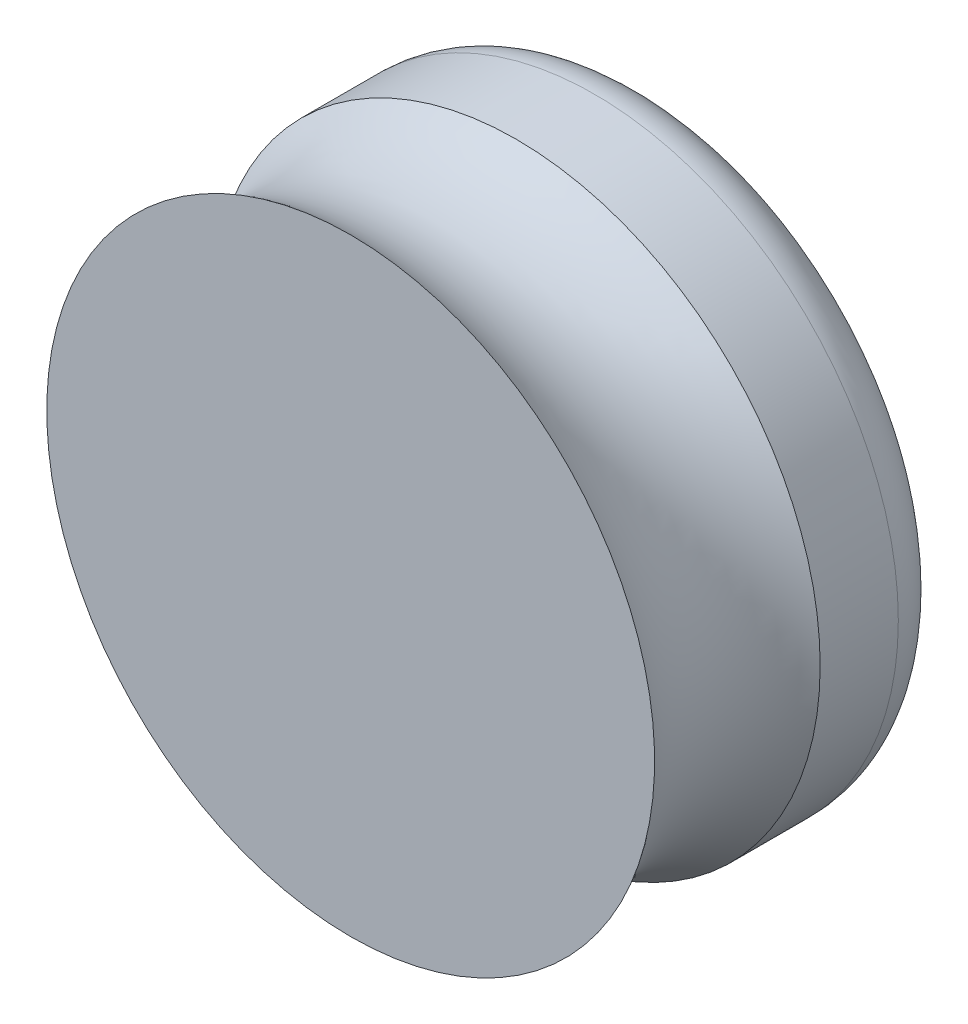
ISO-10303-21;
HEADER;
FILE_DESCRIPTION(('STEP AP214'),'2;1');
FILE_NAME('part.step','',(''),(''),'','','');
FILE_SCHEMA(('AUTOMOTIVE_DESIGN { 1 0 10303 214 1 1 1 1 }'));
ENDSEC;
DATA;
#1=APPLICATION_CONTEXT('core data for automotive mechanical design processes');
#2=APPLICATION_PROTOCOL_DEFINITION('international standard','automotive_design',2000,#1);
#3=PRODUCT_CONTEXT('',#1,'mechanical');
#4=PRODUCT('Part','Part','',(#3));
#5=PRODUCT_RELATED_PRODUCT_CATEGORY('part','',(#4));
#6=PRODUCT_DEFINITION_FORMATION('','',#4);
#7=PRODUCT_DEFINITION_CONTEXT('part definition',#1,'design');
#8=PRODUCT_DEFINITION('design','',#6,#7);
#9=PRODUCT_DEFINITION_SHAPE('','',#8);
#10=(LENGTH_UNIT() NAMED_UNIT(*) SI_UNIT(.MILLI.,.METRE.));
#11=(NAMED_UNIT(*) PLANE_ANGLE_UNIT() SI_UNIT($,.RADIAN.));
#12=(NAMED_UNIT(*) SI_UNIT($,.STERADIAN.) SOLID_ANGLE_UNIT());
#13=UNCERTAINTY_MEASURE_WITH_UNIT(LENGTH_MEASURE(1.E-05),#10,'distance_accuracy_value','');
#14=(GEOMETRIC_REPRESENTATION_CONTEXT(3) GLOBAL_UNCERTAINTY_ASSIGNED_CONTEXT((#13)) GLOBAL_UNIT_ASSIGNED_CONTEXT((#10,
#11,#12)) REPRESENTATION_CONTEXT('',''));
#15=CARTESIAN_POINT('',(0.,0.,0.));
#16=DIRECTION('',(0.,0.,1.));
#17=DIRECTION('',(1.,0.,0.));
#18=AXIS2_PLACEMENT_3D('',#15,#16,#17);
#19=CARTESIAN_POINT('',(-203.237767720353,-97.4477839792411,-9.99999999999989));
#20=DIRECTION('',(0.,0.,-1.));
#21=DIRECTION('',(-1.,0.,0.));
#22=AXIS2_PLACEMENT_3D('',#19,#20,#21);
#23=PLANE('',#22);
#24=CARTESIAN_POINT('',(-205.237767720353,-97.4477839792411,-9.99999999999989));
#25=DIRECTION('',(0.,0.,-1.));
#26=DIRECTION('',(-1.,0.,0.));
#27=AXIS2_PLACEMENT_3D('',#24,#25,#26);
#28=CIRCLE('',#27,4.00000000000003);
#29=CARTESIAN_POINT('',(-209.237767720353,-97.4477839792411,-9.99999999999989));
#30=VERTEX_POINT('',#29);
#31=EDGE_CURVE('E23',#30,#30,#28,.F.);
#32=ORIENTED_EDGE('',*,*,#31,.F.);
#33=EDGE_LOOP('',(#32));
#34=FACE_BOUND('',#33,.T.);
#35=ADVANCED_FACE('F19',(#34),#23,.T.);
#36=CARTESIAN_POINT('',(-205.237767720353,-97.4477839792411,-9.99999999999989));
#37=DIRECTION('',(0.,0.,-1.));
#38=DIRECTION('',(-1.,0.,0.));
#39=AXIS2_PLACEMENT_3D('',#36,#37,#38);
#40=CYLINDRICAL_SURFACE('',#39,4.00000000000003);
#41=ORIENTED_EDGE('',*,*,#31,.T.);
#42=EDGE_LOOP('',(#41));
#43=FACE_BOUND('',#42,.T.);
#44=CARTESIAN_POINT('',(-205.237767720353,-97.4477839792411,-9.87999999999989));
#45=DIRECTION('',(0.,0.,1.));
#46=DIRECTION('',(1.,0.,0.));
#47=AXIS2_PLACEMENT_3D('',#44,#45,#46);
#48=CIRCLE('',#47,4.);
#49=CARTESIAN_POINT('',(-201.237767720353,-97.4477839792411,-9.87999999999989));
#50=VERTEX_POINT('',#49);
#51=EDGE_CURVE('E34',#50,#50,#48,.T.);
#52=ORIENTED_EDGE('',*,*,#51,.F.);
#53=EDGE_LOOP('',(#52));
#54=FACE_BOUND('',#53,.T.);
#55=ADVANCED_FACE('F45',(#43,#54),#40,.T.);
#56=CARTESIAN_POINT('',(-205.237767720353,-97.4477839792411,-8.99999999999986));
#57=DIRECTION('',(0.,0.,-1.));
#58=DIRECTION('',(-1.,0.,0.));
#59=AXIS2_PLACEMENT_3D('',#56,#57,#58);
#60=TOROIDAL_SURFACE('',#59,4.00000000000005,0.880000000000008);
#61=ORIENTED_EDGE('',*,*,#51,.T.);
#62=EDGE_LOOP('',(#61));
#63=FACE_BOUND('',#62,.T.);
#64=CARTESIAN_POINT('',(-205.237767720353,-97.4477839792411,-8.99999999999989));
#65=DIRECTION('',(0.,0.,1.));
#66=DIRECTION('',(1.,0.,0.));
#67=AXIS2_PLACEMENT_3D('',#64,#65,#66);
#68=CIRCLE('',#67,4.88000000000005);
#69=CARTESIAN_POINT('',(-200.357767720353,-97.4477839792411,-8.99999999999989));
#70=VERTEX_POINT('',#69);
#71=EDGE_CURVE('E31',#70,#70,#68,.T.);
#72=ORIENTED_EDGE('',*,*,#71,.F.);
#73=EDGE_LOOP('',(#72));
#74=FACE_BOUND('',#73,.T.);
#75=ADVANCED_FACE('F43',(#63,#74),#60,.T.);
#76=CARTESIAN_POINT('',(-205.237767720353,-97.4477839792411,-8.35236999988197));
#77=DIRECTION('',(0.,0.,1.));
#78=DIRECTION('',(1.,0.,0.));
#79=AXIS2_PLACEMENT_3D('',#76,#77,#78);
#80=CYLINDRICAL_SURFACE('',#79,4.88000000000005);
#81=ORIENTED_EDGE('',*,*,#71,.T.);
#82=EDGE_LOOP('',(#81));
#83=FACE_BOUND('',#82,.T.);
#84=CARTESIAN_POINT('',(-205.237767720353,-97.4477839792411,-7.74504137363951));
#85=DIRECTION('',(0.,0.,-1.));
#86=DIRECTION('',(-1.,0.,0.));
#87=AXIS2_PLACEMENT_3D('',#84,#85,#86);
#88=CIRCLE('',#87,4.88000000000002);
#89=CARTESIAN_POINT('',(-210.117767720353,-97.4477839792411,-7.74504137363952));
#90=VERTEX_POINT('',#89);
#91=EDGE_CURVE('E27',#90,#90,#88,.T.);
#92=ORIENTED_EDGE('',*,*,#91,.T.);
#93=EDGE_LOOP('',(#92));
#94=FACE_BOUND('',#93,.T.);
#95=ADVANCED_FACE('F40',(#83,#94),#80,.T.);
#96=CARTESIAN_POINT('',(-205.237767720353,-97.4477839792411,-6.41579999963511));
#97=DIRECTION('',(0.,0.,-1.));
#98=DIRECTION('',(0.,1.,0.));
#99=AXIS2_PLACEMENT_3D('',#96,#97,#98);
#100=TOROIDAL_SURFACE('',#99,6.66958809878968,2.22923937559309);
#101=ORIENTED_EDGE('',*,*,#91,.F.);
#102=EDGE_LOOP('',(#101));
#103=FACE_BOUND('',#102,.T.);
#104=CARTESIAN_POINT('',(-205.237767720353,-97.4477839792411,-5.08655862563024));
#105=DIRECTION('',(0.,0.,-1.));
#106=DIRECTION('',(0.,1.,0.));
#107=AXIS2_PLACEMENT_3D('',#104,#105,#106);
#108=CIRCLE('',#107,4.88000000000037);
#109=CARTESIAN_POINT('',(-205.237767720353,-92.5677839792407,-5.08655862563024));
#110=VERTEX_POINT('',#109);
#111=EDGE_CURVE('E11',#110,#110,#108,.T.);
#112=ORIENTED_EDGE('',*,*,#111,.T.);
#113=EDGE_LOOP('',(#112));
#114=FACE_BOUND('',#113,.T.);
#115=ADVANCED_FACE('F21',(#103,#114),#100,.F.);
#116=CARTESIAN_POINT('',(-205.237767720353,-97.4477839792411,-5.08655862563023));
#117=DIRECTION('',(0.,0.,-1.));
#118=DIRECTION('',(-1.,0.,0.));
#119=AXIS2_PLACEMENT_3D('',#116,#117,#118);
#120=PLANE('',#119);
#121=ORIENTED_EDGE('',*,*,#111,.F.);
#122=EDGE_LOOP('',(#121));
#123=FACE_BOUND('',#122,.T.);
#124=ADVANCED_FACE('F56',(#123),#120,.F.);
#125=CLOSED_SHELL('',(#35,#55,#75,#95,#115,#124));
#126=MANIFOLD_SOLID_BREP('B1',#125);
#127=ADVANCED_BREP_SHAPE_REPRESENTATION('',(#18,#126),#14);
#128=SHAPE_DEFINITION_REPRESENTATION(#9,#127);
ENDSEC;
END-ISO-10303-21;
